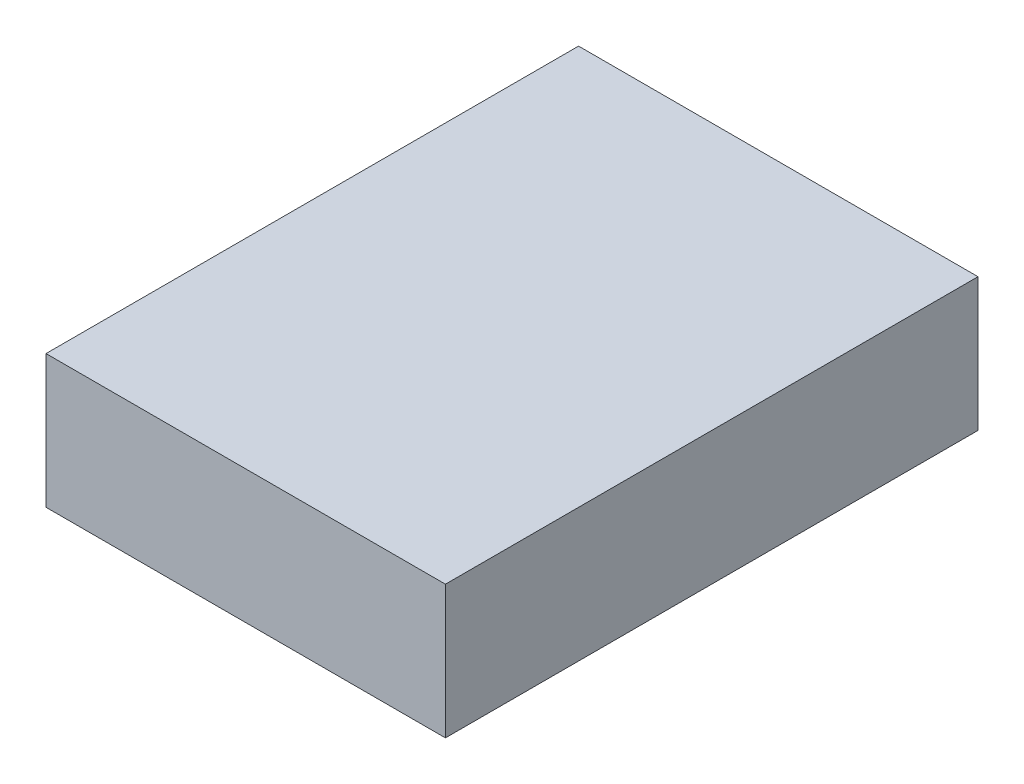
ISO-10303-21;
HEADER;
FILE_DESCRIPTION(('STEP AP214'),'2;1');
FILE_NAME('part.step','',(''),(''),'','','');
FILE_SCHEMA(('AUTOMOTIVE_DESIGN { 1 0 10303 214 1 1 1 1 }'));
ENDSEC;
DATA;
#1=APPLICATION_CONTEXT('core data for automotive mechanical design processes');
#2=APPLICATION_PROTOCOL_DEFINITION('international standard','automotive_design',2000,#1);
#3=PRODUCT_CONTEXT('',#1,'mechanical');
#4=PRODUCT('Part','Part','',(#3));
#5=PRODUCT_RELATED_PRODUCT_CATEGORY('part','',(#4));
#6=PRODUCT_DEFINITION_FORMATION('','',#4);
#7=PRODUCT_DEFINITION_CONTEXT('part definition',#1,'design');
#8=PRODUCT_DEFINITION('design','',#6,#7);
#9=PRODUCT_DEFINITION_SHAPE('','',#8);
#10=(LENGTH_UNIT() NAMED_UNIT(*) SI_UNIT(.MILLI.,.METRE.));
#11=(NAMED_UNIT(*) PLANE_ANGLE_UNIT() SI_UNIT($,.RADIAN.));
#12=(NAMED_UNIT(*) SI_UNIT($,.STERADIAN.) SOLID_ANGLE_UNIT());
#13=UNCERTAINTY_MEASURE_WITH_UNIT(LENGTH_MEASURE(1.E-05),#10,'distance_accuracy_value','');
#14=(GEOMETRIC_REPRESENTATION_CONTEXT(3) GLOBAL_UNCERTAINTY_ASSIGNED_CONTEXT((#13)) GLOBAL_UNIT_ASSIGNED_CONTEXT((#10,
#11,#12)) REPRESENTATION_CONTEXT('',''));
#15=CARTESIAN_POINT('',(0.,0.,0.));
#16=DIRECTION('',(0.,0.,1.));
#17=DIRECTION('',(1.,0.,0.));
#18=AXIS2_PLACEMENT_3D('',#15,#16,#17);
#19=CARTESIAN_POINT('',(0.15000224,-0.04999989999999,0.));
#20=DIRECTION('',(0.,-1.,0.));
#21=DIRECTION('',(0.,0.,-1.));
#22=AXIS2_PLACEMENT_3D('',#19,#20,#21);
#23=PLANE('',#22);
#24=DIRECTION('',(0.,0.,1.));
#25=VECTOR('',#24,1.);
#26=CARTESIAN_POINT('',(-0.1499997,-0.04999989999999,0.));
#27=LINE('',#26,#25);
#28=CARTESIAN_POINT('',(-0.1499997,-0.04999989999999,0.));
#29=VERTEX_POINT('',#28);
#30=CARTESIAN_POINT('',(-0.1499997,-0.04999989999999,0.3999992));
#31=VERTEX_POINT('',#30);
#32=EDGE_CURVE('E20',#29,#31,#27,.T.);
#33=ORIENTED_EDGE('',*,*,#32,.F.);
#34=DIRECTION('',(1.,0.,0.));
#35=VECTOR('',#34,1.);
#36=CARTESIAN_POINT('',(-0.1499997,-0.04999989999999,0.));
#37=LINE('',#36,#35);
#38=CARTESIAN_POINT('',(0.15000224,-0.04999989999999,0.));
#39=VERTEX_POINT('',#38);
#40=EDGE_CURVE('E80',#29,#39,#37,.T.);
#41=ORIENTED_EDGE('',*,*,#40,.T.);
#42=DIRECTION('',(0.,0.,-1.));
#43=VECTOR('',#42,1.);
#44=CARTESIAN_POINT('',(0.15000224,-0.04999989999999,0.));
#45=LINE('',#44,#43);
#46=CARTESIAN_POINT('',(0.15000224,-0.04999989999999,0.3999992));
#47=VERTEX_POINT('',#46);
#48=EDGE_CURVE('E68',#47,#39,#45,.T.);
#49=ORIENTED_EDGE('',*,*,#48,.F.);
#50=DIRECTION('',(1.,0.,0.));
#51=VECTOR('',#50,1.);
#52=CARTESIAN_POINT('',(-0.1499997,-0.04999989999999,0.3999992));
#53=LINE('',#52,#51);
#54=EDGE_CURVE('E56',#31,#47,#53,.T.);
#55=ORIENTED_EDGE('',*,*,#54,.F.);
#56=EDGE_LOOP('',(#33,#41,#49,#55));
#57=FACE_BOUND('',#56,.T.);
#58=ADVANCED_FACE('F17',(#57),#23,.T.);
#59=CARTESIAN_POINT('',(-0.1499997,-0.04999989999999,0.));
#60=DIRECTION('',(-1.,0.,0.));
#61=DIRECTION('',(0.,0.,1.));
#62=AXIS2_PLACEMENT_3D('',#59,#60,#61);
#63=PLANE('',#62);
#64=DIRECTION('',(0.,0.,1.));
#65=VECTOR('',#64,1.);
#66=CARTESIAN_POINT('',(-0.1499997,0.04999990000002,0.));
#67=LINE('',#66,#65);
#68=CARTESIAN_POINT('',(-0.1499997,0.04999990000002,0.));
#69=VERTEX_POINT('',#68);
#70=CARTESIAN_POINT('',(-0.1499997,0.04999990000002,0.3999992));
#71=VERTEX_POINT('',#70);
#72=EDGE_CURVE('E83',#69,#71,#67,.T.);
#73=ORIENTED_EDGE('',*,*,#72,.F.);
#74=DIRECTION('',(0.,1.,0.));
#75=VECTOR('',#74,1.);
#76=CARTESIAN_POINT('',(-0.1499997,0.04999990000002,0.));
#77=LINE('',#76,#75);
#78=EDGE_CURVE('E65',#69,#29,#77,.F.);
#79=ORIENTED_EDGE('',*,*,#78,.T.);
#80=ORIENTED_EDGE('',*,*,#32,.T.);
#81=DIRECTION('',(0.,1.,0.));
#82=VECTOR('',#81,1.);
#83=CARTESIAN_POINT('',(-0.1499997,0.04999990000002,0.3999992));
#84=LINE('',#83,#82);
#85=EDGE_CURVE('E62',#71,#31,#84,.F.);
#86=ORIENTED_EDGE('',*,*,#85,.F.);
#87=EDGE_LOOP('',(#73,#79,#80,#86));
#88=FACE_BOUND('',#87,.T.);
#89=ADVANCED_FACE('F61',(#88),#63,.T.);
#90=CARTESIAN_POINT('',(-0.1499997,0.04999990000002,0.3999992));
#91=DIRECTION('',(0.,0.,1.));
#92=DIRECTION('',(1.,0.,0.));
#93=AXIS2_PLACEMENT_3D('',#90,#91,#92);
#94=PLANE('',#93);
#95=DIRECTION('',(0.,1.,0.));
#96=VECTOR('',#95,1.);
#97=CARTESIAN_POINT('',(0.15000224,0.04999990000002,0.3999992));
#98=LINE('',#97,#96);
#99=CARTESIAN_POINT('',(0.15000224,0.04999990000002,0.3999992));
#100=VERTEX_POINT('',#99);
#101=EDGE_CURVE('E70',#100,#47,#98,.F.);
#102=ORIENTED_EDGE('',*,*,#101,.F.);
#103=DIRECTION('',(1.,0.,0.));
#104=VECTOR('',#103,1.);
#105=CARTESIAN_POINT('',(-0.1499997,0.04999990000002,0.3999992));
#106=LINE('',#105,#104);
#107=EDGE_CURVE('E74',#71,#100,#106,.T.);
#108=ORIENTED_EDGE('',*,*,#107,.F.);
#109=ORIENTED_EDGE('',*,*,#85,.T.);
#110=ORIENTED_EDGE('',*,*,#54,.T.);
#111=EDGE_LOOP('',(#102,#108,#109,#110));
#112=FACE_BOUND('',#111,.T.);
#113=ADVANCED_FACE('F72',(#112),#94,.T.);
#114=CARTESIAN_POINT('',(0.15000224,0.04999990000002,0.));
#115=DIRECTION('',(1.,0.,0.));
#116=DIRECTION('',(0.,0.,-1.));
#117=AXIS2_PLACEMENT_3D('',#114,#115,#116);
#118=PLANE('',#117);
#119=ORIENTED_EDGE('',*,*,#48,.T.);
#120=DIRECTION('',(0.,1.,0.));
#121=VECTOR('',#120,1.);
#122=CARTESIAN_POINT('',(0.15000224,0.04999990000002,0.));
#123=LINE('',#122,#121);
#124=CARTESIAN_POINT('',(0.15000224,0.04999990000002,0.));
#125=VERTEX_POINT('',#124);
#126=EDGE_CURVE('E35',#39,#125,#123,.T.);
#127=ORIENTED_EDGE('',*,*,#126,.T.);
#128=DIRECTION('',(0.,0.,1.));
#129=VECTOR('',#128,1.);
#130=CARTESIAN_POINT('',(0.15000224,0.04999990000002,0.));
#131=LINE('',#130,#129);
#132=EDGE_CURVE('E26',#100,#125,#131,.F.);
#133=ORIENTED_EDGE('',*,*,#132,.F.);
#134=ORIENTED_EDGE('',*,*,#101,.T.);
#135=EDGE_LOOP('',(#119,#127,#133,#134));
#136=FACE_BOUND('',#135,.T.);
#137=ADVANCED_FACE('F89',(#136),#118,.T.);
#138=CARTESIAN_POINT('',(-0.1499997,0.04999990000002,0.));
#139=DIRECTION('',(0.,0.,1.));
#140=DIRECTION('',(1.,0.,0.));
#141=AXIS2_PLACEMENT_3D('',#138,#139,#140);
#142=PLANE('',#141);
#143=ORIENTED_EDGE('',*,*,#126,.F.);
#144=ORIENTED_EDGE('',*,*,#40,.F.);
#145=ORIENTED_EDGE('',*,*,#78,.F.);
#146=DIRECTION('',(1.,0.,0.));
#147=VECTOR('',#146,1.);
#148=CARTESIAN_POINT('',(-0.1499997,0.04999990000002,0.));
#149=LINE('',#148,#147);
#150=EDGE_CURVE('E11',#125,#69,#149,.F.);
#151=ORIENTED_EDGE('',*,*,#150,.F.);
#152=EDGE_LOOP('',(#143,#144,#145,#151));
#153=FACE_BOUND('',#152,.T.);
#154=ADVANCED_FACE('F91',(#153),#142,.F.);
#155=CARTESIAN_POINT('',(-0.1499997,0.04999990000002,0.));
#156=DIRECTION('',(0.,1.,0.));
#157=DIRECTION('',(0.,0.,1.));
#158=AXIS2_PLACEMENT_3D('',#155,#156,#157);
#159=PLANE('',#158);
#160=ORIENTED_EDGE('',*,*,#132,.T.);
#161=ORIENTED_EDGE('',*,*,#150,.T.);
#162=ORIENTED_EDGE('',*,*,#72,.T.);
#163=ORIENTED_EDGE('',*,*,#107,.T.);
#164=EDGE_LOOP('',(#160,#161,#162,#163));
#165=FACE_BOUND('',#164,.T.);
#166=ADVANCED_FACE('F88',(#165),#159,.T.);
#167=CLOSED_SHELL('',(#58,#89,#113,#137,#154,#166));
#168=MANIFOLD_SOLID_BREP('B1',#167);
#169=ADVANCED_BREP_SHAPE_REPRESENTATION('',(#18,#168),#14);
#170=SHAPE_DEFINITION_REPRESENTATION(#9,#169);
ENDSEC;
END-ISO-10303-21;
